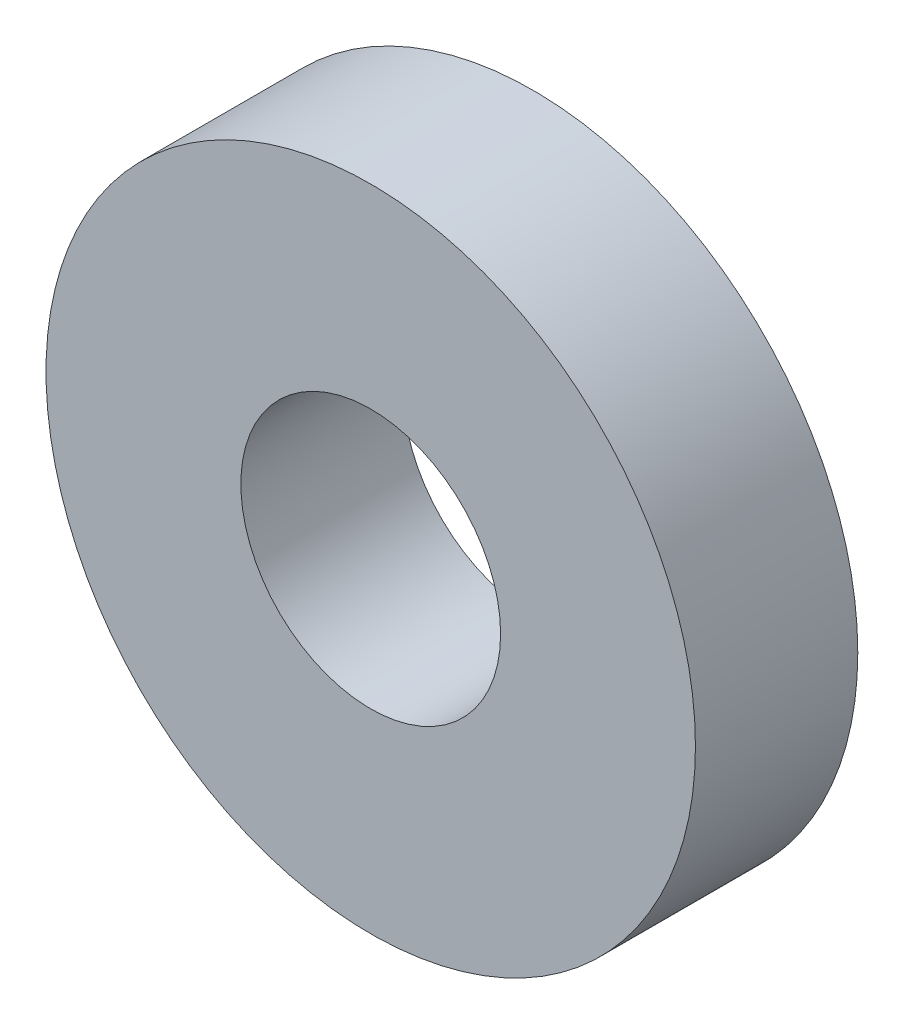
ISO-10303-21;
HEADER;
FILE_DESCRIPTION(('STEP AP214'),'2;1');
FILE_NAME('part.step','',(''),(''),'','','');
FILE_SCHEMA(('AUTOMOTIVE_DESIGN { 1 0 10303 214 1 1 1 1 }'));
ENDSEC;
DATA;
#1=APPLICATION_CONTEXT('core data for automotive mechanical design processes');
#2=APPLICATION_PROTOCOL_DEFINITION('international standard','automotive_design',2000,#1);
#3=PRODUCT_CONTEXT('',#1,'mechanical');
#4=PRODUCT('Part','Part','',(#3));
#5=PRODUCT_RELATED_PRODUCT_CATEGORY('part','',(#4));
#6=PRODUCT_DEFINITION_FORMATION('','',#4);
#7=PRODUCT_DEFINITION_CONTEXT('part definition',#1,'design');
#8=PRODUCT_DEFINITION('design','',#6,#7);
#9=PRODUCT_DEFINITION_SHAPE('','',#8);
#10=(LENGTH_UNIT() NAMED_UNIT(*) SI_UNIT(.MILLI.,.METRE.));
#11=(NAMED_UNIT(*) PLANE_ANGLE_UNIT() SI_UNIT($,.RADIAN.));
#12=(NAMED_UNIT(*) SI_UNIT($,.STERADIAN.) SOLID_ANGLE_UNIT());
#13=UNCERTAINTY_MEASURE_WITH_UNIT(LENGTH_MEASURE(1.E-05),#10,'distance_accuracy_value','');
#14=(GEOMETRIC_REPRESENTATION_CONTEXT(3) GLOBAL_UNCERTAINTY_ASSIGNED_CONTEXT((#13)) GLOBAL_UNIT_ASSIGNED_CONTEXT((#10,
#11,#12)) REPRESENTATION_CONTEXT('',''));
#15=CARTESIAN_POINT('',(0.,0.,0.));
#16=DIRECTION('',(0.,0.,1.));
#17=DIRECTION('',(1.,0.,0.));
#18=AXIS2_PLACEMENT_3D('',#15,#16,#17);
#19=CARTESIAN_POINT('',(0.,0.,5.));
#20=DIRECTION('',(0.,0.,1.));
#21=DIRECTION('',(1.,0.,0.));
#22=AXIS2_PLACEMENT_3D('',#19,#20,#21);
#23=PLANE('',#22);
#24=CARTESIAN_POINT('',(0.,0.,5.));
#25=DIRECTION('',(0.,0.,1.));
#26=DIRECTION('',(1.,0.,0.));
#27=AXIS2_PLACEMENT_3D('',#24,#25,#26);
#28=CIRCLE('',#27,10.);
#29=CARTESIAN_POINT('',(10.,0.,5.));
#30=VERTEX_POINT('',#29);
#31=EDGE_CURVE('E11',#30,#30,#28,.T.);
#32=ORIENTED_EDGE('',*,*,#31,.T.);
#33=EDGE_LOOP('',(#32));
#34=FACE_BOUND('',#33,.T.);
#35=CARTESIAN_POINT('',(0.,0.,5.));
#36=DIRECTION('',(0.,0.,1.));
#37=DIRECTION('',(1.,0.,0.));
#38=AXIS2_PLACEMENT_3D('',#35,#36,#37);
#39=CIRCLE('',#38,4.);
#40=CARTESIAN_POINT('',(4.,0.,5.));
#41=VERTEX_POINT('',#40);
#42=EDGE_CURVE('E56',#41,#41,#39,.T.);
#43=ORIENTED_EDGE('',*,*,#42,.F.);
#44=EDGE_LOOP('',(#43));
#45=FACE_BOUND('',#44,.T.);
#46=ADVANCED_FACE('F43',(#34,#45),#23,.T.);
#47=CARTESIAN_POINT('',(0.,0.,0.));
#48=DIRECTION('',(0.,0.,1.));
#49=DIRECTION('',(1.,0.,0.));
#50=AXIS2_PLACEMENT_3D('',#47,#48,#49);
#51=PLANE('',#50);
#52=CARTESIAN_POINT('',(0.,0.,0.));
#53=DIRECTION('',(0.,0.,1.));
#54=DIRECTION('',(1.,0.,0.));
#55=AXIS2_PLACEMENT_3D('',#52,#53,#54);
#56=CIRCLE('',#55,10.);
#57=CARTESIAN_POINT('',(10.,0.,0.));
#58=VERTEX_POINT('',#57);
#59=EDGE_CURVE('E47',#58,#58,#56,.T.);
#60=ORIENTED_EDGE('',*,*,#59,.F.);
#61=EDGE_LOOP('',(#60));
#62=FACE_BOUND('',#61,.T.);
#63=CARTESIAN_POINT('',(0.,0.,0.));
#64=DIRECTION('',(0.,0.,1.));
#65=DIRECTION('',(1.,0.,0.));
#66=AXIS2_PLACEMENT_3D('',#63,#64,#65);
#67=CIRCLE('',#66,4.);
#68=CARTESIAN_POINT('',(4.,0.,0.));
#69=VERTEX_POINT('',#68);
#70=EDGE_CURVE('E58',#69,#69,#67,.T.);
#71=ORIENTED_EDGE('',*,*,#70,.T.);
#72=EDGE_LOOP('',(#71));
#73=FACE_BOUND('',#72,.T.);
#74=ADVANCED_FACE('F70',(#62,#73),#51,.F.);
#75=CARTESIAN_POINT('',(0.,0.,5.));
#76=DIRECTION('',(0.,0.,-1.));
#77=DIRECTION('',(-1.,0.,0.));
#78=AXIS2_PLACEMENT_3D('',#75,#76,#77);
#79=CYLINDRICAL_SURFACE('',#78,10.);
#80=ORIENTED_EDGE('',*,*,#31,.F.);
#81=EDGE_LOOP('',(#80));
#82=FACE_BOUND('',#81,.T.);
#83=ORIENTED_EDGE('',*,*,#59,.T.);
#84=EDGE_LOOP('',(#83));
#85=FACE_BOUND('',#84,.T.);
#86=ADVANCED_FACE('F45',(#82,#85),#79,.T.);
#87=CARTESIAN_POINT('',(0.,0.,5.));
#88=DIRECTION('',(0.,0.,-1.));
#89=DIRECTION('',(-1.,0.,0.));
#90=AXIS2_PLACEMENT_3D('',#87,#88,#89);
#91=CYLINDRICAL_SURFACE('',#90,4.);
#92=ORIENTED_EDGE('',*,*,#42,.T.);
#93=EDGE_LOOP('',(#92));
#94=FACE_BOUND('',#93,.T.);
#95=ORIENTED_EDGE('',*,*,#70,.F.);
#96=EDGE_LOOP('',(#95));
#97=FACE_BOUND('',#96,.T.);
#98=ADVANCED_FACE('F66',(#94,#97),#91,.F.);
#99=CLOSED_SHELL('',(#46,#74,#86,#98));
#100=MANIFOLD_SOLID_BREP('B2',#99);
#101=ADVANCED_BREP_SHAPE_REPRESENTATION('',(#18,#100),#14);
#102=SHAPE_DEFINITION_REPRESENTATION(#9,#101);
ENDSEC;
END-ISO-10303-21;
